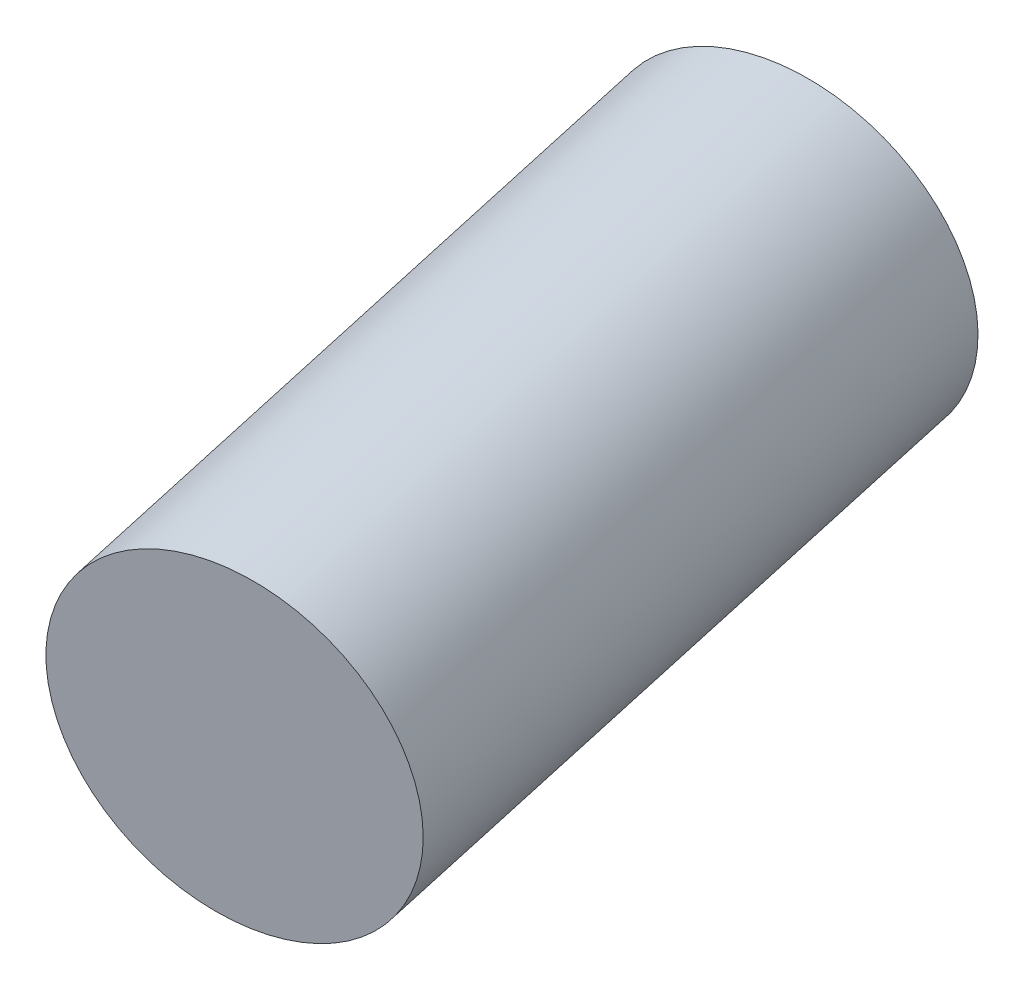
ISO-10303-21;
HEADER;
FILE_DESCRIPTION(('STEP AP214'),'2;1');
FILE_NAME('part.step','',(''),(''),'','','');
FILE_SCHEMA(('AUTOMOTIVE_DESIGN { 1 0 10303 214 1 1 1 1 }'));
ENDSEC;
DATA;
#1=APPLICATION_CONTEXT('core data for automotive mechanical design processes');
#2=APPLICATION_PROTOCOL_DEFINITION('international standard','automotive_design',2000,#1);
#3=PRODUCT_CONTEXT('',#1,'mechanical');
#4=PRODUCT('Part','Part','',(#3));
#5=PRODUCT_RELATED_PRODUCT_CATEGORY('part','',(#4));
#6=PRODUCT_DEFINITION_FORMATION('','',#4);
#7=PRODUCT_DEFINITION_CONTEXT('part definition',#1,'design');
#8=PRODUCT_DEFINITION('design','',#6,#7);
#9=PRODUCT_DEFINITION_SHAPE('','',#8);
#10=(LENGTH_UNIT() NAMED_UNIT(*) SI_UNIT(.MILLI.,.METRE.));
#11=(NAMED_UNIT(*) PLANE_ANGLE_UNIT() SI_UNIT($,.RADIAN.));
#12=(NAMED_UNIT(*) SI_UNIT($,.STERADIAN.) SOLID_ANGLE_UNIT());
#13=UNCERTAINTY_MEASURE_WITH_UNIT(LENGTH_MEASURE(1.E-05),#10,'distance_accuracy_value','');
#14=(GEOMETRIC_REPRESENTATION_CONTEXT(3) GLOBAL_UNCERTAINTY_ASSIGNED_CONTEXT((#13)) GLOBAL_UNIT_ASSIGNED_CONTEXT((#10,
#11,#12)) REPRESENTATION_CONTEXT('',''));
#15=CARTESIAN_POINT('',(0.,0.,0.));
#16=DIRECTION('',(0.,0.,1.));
#17=DIRECTION('',(1.,0.,0.));
#18=AXIS2_PLACEMENT_3D('',#15,#16,#17);
#19=CARTESIAN_POINT('',(-9.62646498755638,5.55784215191033,4.48352085995661));
#20=DIRECTION('',(-0.150383733180432,0.0868240888334654,-0.984807753012209));
#21=DIRECTION('',(-0.852868531952438,0.492403876506114,0.173648177666928));
#22=AXIS2_PLACEMENT_3D('',#19,#20,#21);
#23=PLANE('',#22);
#24=CARTESIAN_POINT('',(-9.62646498755639,5.55784215191034,4.48352085995661));
#25=DIRECTION('',(0.150383733180432,-0.0868240888334655,0.984807753012209));
#26=DIRECTION('',(0.852868531952438,-0.492403876506114,-0.173648177666928));
#27=AXIS2_PLACEMENT_3D('',#24,#25,#26);
#28=CIRCLE('',#27,1.93220030269667);
#29=CARTESIAN_POINT('',(-7.97855215195742,4.60641923267621,4.14799779850585));
#30=VERTEX_POINT('',#29);
#31=EDGE_CURVE('E10',#30,#30,#28,.T.);
#32=ORIENTED_EDGE('',*,*,#31,.T.);
#33=EDGE_LOOP('',(#32));
#34=FACE_BOUND('',#33,.T.);
#35=ADVANCED_FACE('F15',(#34),#23,.F.);
#36=CARTESIAN_POINT('',(-9.46265533813219,5.46326660671941,5.55625000000001));
#37=DIRECTION('',(0.150383733180432,-0.0868240888334655,0.984807753012209));
#38=DIRECTION('',(0.852868531952438,-0.492403876506114,-0.173648177666928));
#39=AXIS2_PLACEMENT_3D('',#36,#37,#38);
#40=CYLINDRICAL_SURFACE('',#39,1.93220030269667);
#41=ORIENTED_EDGE('',*,*,#31,.F.);
#42=EDGE_LOOP('',(#41));
#43=FACE_BOUND('',#42,.T.);
#44=CARTESIAN_POINT('',(-10.7959490356234,6.23304408187481,-3.175));
#45=DIRECTION('',(0.150383733180432,-0.0868240888334655,0.984807753012209));
#46=DIRECTION('',(0.852868531952438,-0.492403876506114,-0.173648177666928));
#47=AXIS2_PLACEMENT_3D('',#44,#45,#46);
#48=CIRCLE('',#47,1.93220030269668);
#49=CARTESIAN_POINT('',(-9.14803620002443,5.28162116264068,-3.51052306145076));
#50=VERTEX_POINT('',#49);
#51=EDGE_CURVE('E19',#50,#50,#48,.T.);
#52=ORIENTED_EDGE('',*,*,#51,.T.);
#53=EDGE_LOOP('',(#52));
#54=FACE_BOUND('',#53,.T.);
#55=ADVANCED_FACE('F28',(#43,#54),#40,.T.);
#56=CARTESIAN_POINT('',(-12.4438618712224,7.18446700110894,-2.83947693854923));
#57=DIRECTION('',(0.150383733180432,-0.0868240888334654,0.984807753012209));
#58=DIRECTION('',(0.852868531952438,-0.492403876506114,-0.173648177666928));
#59=AXIS2_PLACEMENT_3D('',#56,#57,#58);
#60=PLANE('',#59);
#61=ORIENTED_EDGE('',*,*,#51,.F.);
#62=EDGE_LOOP('',(#61));
#63=FACE_BOUND('',#62,.T.);
#64=ADVANCED_FACE('F17',(#63),#60,.F.);
#65=CLOSED_SHELL('',(#35,#55,#64));
#66=MANIFOLD_SOLID_BREP('B1',#65);
#67=ADVANCED_BREP_SHAPE_REPRESENTATION('',(#18,#66),#14);
#68=SHAPE_DEFINITION_REPRESENTATION(#9,#67);
ENDSEC;
END-ISO-10303-21;
